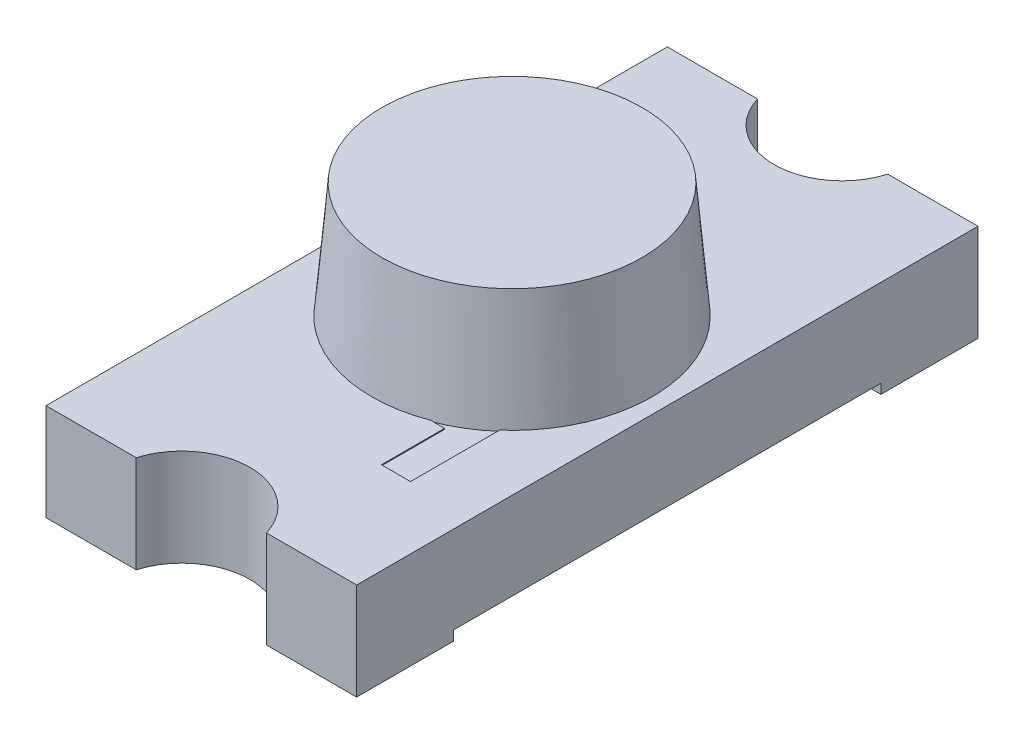
ISO-10303-21;
HEADER;
FILE_DESCRIPTION(('STEP AP214'),'2;1');
FILE_NAME('part.step','',(''),(''),'','','');
FILE_SCHEMA(('AUTOMOTIVE_DESIGN { 1 0 10303 214 1 1 1 1 }'));
ENDSEC;
DATA;
#1=APPLICATION_CONTEXT('core data for automotive mechanical design processes');
#2=APPLICATION_PROTOCOL_DEFINITION('international standard','automotive_design',2000,#1);
#3=PRODUCT_CONTEXT('',#1,'mechanical');
#4=PRODUCT('Part','Part','',(#3));
#5=PRODUCT_RELATED_PRODUCT_CATEGORY('part','',(#4));
#6=PRODUCT_DEFINITION_FORMATION('','',#4);
#7=PRODUCT_DEFINITION_CONTEXT('part definition',#1,'design');
#8=PRODUCT_DEFINITION('design','',#6,#7);
#9=PRODUCT_DEFINITION_SHAPE('','',#8);
#10=(LENGTH_UNIT() NAMED_UNIT(*) SI_UNIT(.MILLI.,.METRE.));
#11=(NAMED_UNIT(*) PLANE_ANGLE_UNIT() SI_UNIT($,.RADIAN.));
#12=(NAMED_UNIT(*) SI_UNIT($,.STERADIAN.) SOLID_ANGLE_UNIT());
#13=UNCERTAINTY_MEASURE_WITH_UNIT(LENGTH_MEASURE(1.E-05),#10,'distance_accuracy_value','');
#14=(GEOMETRIC_REPRESENTATION_CONTEXT(3) GLOBAL_UNCERTAINTY_ASSIGNED_CONTEXT((#13)) GLOBAL_UNIT_ASSIGNED_CONTEXT((#10,
#11,#12)) REPRESENTATION_CONTEXT('',''));
#15=CARTESIAN_POINT('',(0.,0.,0.));
#16=DIRECTION('',(0.,0.,1.));
#17=DIRECTION('',(1.,0.,0.));
#18=AXIS2_PLACEMENT_3D('',#15,#16,#17);
#19=CARTESIAN_POINT('',(0.,0.495,0.));
#20=DIRECTION('',(0.,-1.,0.));
#21=DIRECTION('',(0.,0.,1.));
#22=AXIS2_PLACEMENT_3D('',#19,#20,#21);
#23=CONICAL_SURFACE('',#22,0.722303878658216,0.0872664625997167);
#24=CARTESIAN_POINT('',(0.,1.095,0.));
#25=DIRECTION('',(0.,1.,0.));
#26=DIRECTION('',(0.,0.,1.));
#27=AXIS2_PLACEMENT_3D('',#24,#25,#26);
#28=CIRCLE('',#27,0.669810680542662);
#29=CARTESIAN_POINT('',(0.,1.095,0.669810680542662));
#30=VERTEX_POINT('',#29);
#31=EDGE_CURVE('E12',#30,#30,#28,.T.);
#32=ORIENTED_EDGE('',*,*,#31,.F.);
#33=EDGE_LOOP('',(#32));
#34=FACE_BOUND('',#33,.T.);
#35=CARTESIAN_POINT('',(0.,0.495,0.));
#36=DIRECTION('',(0.,1.,0.));
#37=DIRECTION('',(0.,0.,1.));
#38=AXIS2_PLACEMENT_3D('',#35,#36,#37);
#39=CIRCLE('',#38,0.722303878658216);
#40=CARTESIAN_POINT('',(0.,0.495,0.722303878658216));
#41=VERTEX_POINT('',#40);
#42=EDGE_CURVE('E51',#41,#41,#39,.T.);
#43=ORIENTED_EDGE('',*,*,#42,.T.);
#44=EDGE_LOOP('',(#43));
#45=FACE_BOUND('',#44,.T.);
#46=ADVANCED_FACE('F45',(#34,#45),#23,.T.);
#47=CARTESIAN_POINT('',(0.,1.095,0.));
#48=DIRECTION('',(0.,1.,0.));
#49=DIRECTION('',(0.,0.,1.));
#50=AXIS2_PLACEMENT_3D('',#47,#48,#49);
#51=PLANE('',#50);
#52=ORIENTED_EDGE('',*,*,#31,.T.);
#53=EDGE_LOOP('',(#52));
#54=FACE_BOUND('',#53,.T.);
#55=ADVANCED_FACE('F60',(#54),#51,.T.);
#56=CARTESIAN_POINT('',(0.,0.495,0.));
#57=DIRECTION('',(0.,1.,0.));
#58=DIRECTION('',(0.,0.,1.));
#59=AXIS2_PLACEMENT_3D('',#56,#57,#58);
#60=PLANE('',#59);
#61=ORIENTED_EDGE('',*,*,#42,.F.);
#62=EDGE_LOOP('',(#61));
#63=FACE_BOUND('',#62,.T.);
#64=ADVANCED_FACE('F58',(#63),#60,.F.);
#65=CLOSED_SHELL('',(#46,#55,#64));
#66=MANIFOLD_SOLID_BREP('B2',#65);
#67=CARTESIAN_POINT('',(-2.92422569718548,0.495,0.));
#68=DIRECTION('',(0.,1.,0.));
#69=DIRECTION('',(0.,0.,1.));
#70=AXIS2_PLACEMENT_3D('',#67,#68,#69);
#71=PLANE('',#70);
#72=DIRECTION('',(0.,0.,1.));
#73=VECTOR('',#72,1.);
#74=CARTESIAN_POINT('',(0.477379024541812,0.495,0.));
#75=LINE('',#74,#73);
#76=CARTESIAN_POINT('',(0.477379024541812,0.495,0.525));
#77=VERTEX_POINT('',#76);
#78=CARTESIAN_POINT('',(0.477379024541812,0.495,1.));
#79=VERTEX_POINT('',#78);
#80=EDGE_CURVE('E366',#77,#79,#75,.T.);
#81=ORIENTED_EDGE('',*,*,#80,.F.);
#82=DIRECTION('',(1.,0.,0.));
#83=VECTOR('',#82,1.);
#84=CARTESIAN_POINT('',(-2.92422569718548,0.495,0.525));
#85=LINE('',#84,#83);
#86=CARTESIAN_POINT('',(-0.075,0.495,0.525));
#87=VERTEX_POINT('',#86);
#88=EDGE_CURVE('E368',#87,#77,#85,.T.);
#89=ORIENTED_EDGE('',*,*,#88,.F.);
#90=DIRECTION('',(0.,0.,1.));
#91=VECTOR('',#90,1.);
#92=CARTESIAN_POINT('',(-0.075,0.495,0.));
#93=LINE('',#92,#91);
#94=CARTESIAN_POINT('',(-0.075,0.495,0.225));
#95=VERTEX_POINT('',#94);
#96=EDGE_CURVE('E371',#95,#87,#93,.T.);
#97=ORIENTED_EDGE('',*,*,#96,.F.);
#98=DIRECTION('',(1.,0.,0.));
#99=VECTOR('',#98,1.);
#100=CARTESIAN_POINT('',(-2.92422569718548,0.495,0.225000000000001));
#101=LINE('',#100,#99);
#102=CARTESIAN_POINT('',(0.225,0.495,0.225));
#103=VERTEX_POINT('',#102);
#104=EDGE_CURVE('E373',#95,#103,#101,.T.);
#105=ORIENTED_EDGE('',*,*,#104,.T.);
#106=DIRECTION('',(0.,0.,1.));
#107=VECTOR('',#106,1.);
#108=CARTESIAN_POINT('',(0.225,0.495,0.));
#109=LINE('',#108,#107);
#110=CARTESIAN_POINT('',(0.225,0.495,-0.225));
#111=VERTEX_POINT('',#110);
#112=EDGE_CURVE('E376',#111,#103,#109,.T.);
#113=ORIENTED_EDGE('',*,*,#112,.F.);
#114=DIRECTION('',(1.,0.,0.));
#115=VECTOR('',#114,1.);
#116=CARTESIAN_POINT('',(-2.92422569718548,0.495,-0.225));
#117=LINE('',#116,#115);
#118=CARTESIAN_POINT('',(-0.225,0.495,-0.225));
#119=VERTEX_POINT('',#118);
#120=EDGE_CURVE('E378',#119,#111,#117,.T.);
#121=ORIENTED_EDGE('',*,*,#120,.F.);
#122=DIRECTION('',(0.,0.,1.));
#123=VECTOR('',#122,1.);
#124=CARTESIAN_POINT('',(-0.225,0.495,0.));
#125=LINE('',#124,#123);
#126=CARTESIAN_POINT('',(-0.225,0.495,0.675));
#127=VERTEX_POINT('',#126);
#128=EDGE_CURVE('E380',#119,#127,#125,.T.);
#129=ORIENTED_EDGE('',*,*,#128,.T.);
#130=DIRECTION('',(1.,0.,0.));
#131=VECTOR('',#130,1.);
#132=CARTESIAN_POINT('',(-2.92422569718548,0.495,0.675));
#133=LINE('',#132,#131);
#134=CARTESIAN_POINT('',(0.327379024541811,0.495,0.675));
#135=VERTEX_POINT('',#134);
#136=EDGE_CURVE('E383',#127,#135,#133,.T.);
#137=ORIENTED_EDGE('',*,*,#136,.T.);
#138=DIRECTION('',(0.,0.,1.));
#139=VECTOR('',#138,1.);
#140=CARTESIAN_POINT('',(0.327379024541812,0.495,0.));
#141=LINE('',#140,#139);
#142=CARTESIAN_POINT('',(0.327379024541812,0.495,1.));
#143=VERTEX_POINT('',#142);
#144=EDGE_CURVE('E386',#135,#143,#141,.T.);
#145=ORIENTED_EDGE('',*,*,#144,.T.);
#146=DIRECTION('',(1.,0.,0.));
#147=VECTOR('',#146,1.);
#148=CARTESIAN_POINT('',(-2.92422569718548,0.495,1.));
#149=LINE('',#148,#147);
#150=EDGE_CURVE('E389',#143,#79,#149,.T.);
#151=ORIENTED_EDGE('',*,*,#150,.T.);
#152=EDGE_LOOP('',(#81,#89,#97,#105,#113,#121,#129,#137,#145,#151));
#153=FACE_BOUND('',#152,.T.);
#154=DIRECTION('',(1.,0.,0.));
#155=VECTOR('',#154,1.);
#156=CARTESIAN_POINT('',(-0.195,0.495,0.195));
#157=LINE('',#156,#155);
#158=CARTESIAN_POINT('',(-0.195,0.495,0.195));
#159=VERTEX_POINT('',#158);
#160=CARTESIAN_POINT('',(0.195,0.495,0.195));
#161=VERTEX_POINT('',#160);
#162=EDGE_CURVE('E961',#159,#161,#157,.T.);
#163=ORIENTED_EDGE('',*,*,#162,.F.);
#164=DIRECTION('',(0.,0.,1.));
#165=VECTOR('',#164,1.);
#166=CARTESIAN_POINT('',(-0.195,0.495,-0.195));
#167=LINE('',#166,#165);
#168=CARTESIAN_POINT('',(-0.195,0.495,-0.195));
#169=VERTEX_POINT('',#168);
#170=EDGE_CURVE('E316',#169,#159,#167,.T.);
#171=ORIENTED_EDGE('',*,*,#170,.F.);
#172=DIRECTION('',(-1.,0.,0.));
#173=VECTOR('',#172,1.);
#174=CARTESIAN_POINT('',(-0.195,0.495,-0.195));
#175=LINE('',#174,#173);
#176=CARTESIAN_POINT('',(0.195,0.495,-0.195));
#177=VERTEX_POINT('',#176);
#178=EDGE_CURVE('E312',#177,#169,#175,.T.);
#179=ORIENTED_EDGE('',*,*,#178,.F.);
#180=DIRECTION('',(0.,0.,-1.));
#181=VECTOR('',#180,1.);
#182=CARTESIAN_POINT('',(0.195,0.495,-0.195));
#183=LINE('',#182,#181);
#184=EDGE_CURVE('E958',#161,#177,#183,.T.);
#185=ORIENTED_EDGE('',*,*,#184,.F.);
#186=EDGE_LOOP('',(#163,#171,#179,#185));
#187=FACE_BOUND('',#186,.T.);
#188=ADVANCED_FACE('F85',(#153,#187),#71,.T.);
#189=CARTESIAN_POINT('',(0.8,0.5,1.6));
#190=DIRECTION('',(0.,-1.,0.));
#191=DIRECTION('',(0.,0.,-1.));
#192=AXIS2_PLACEMENT_3D('',#189,#190,#191);
#193=PLANE('',#192);
#194=DIRECTION('',(0.,0.,-1.));
#195=VECTOR('',#194,1.);
#196=CARTESIAN_POINT('',(0.276447509101705,0.5,0.));
#197=LINE('',#196,#195);
#198=CARTESIAN_POINT('',(0.276447509101705,0.5,-0.450698671652405));
#199=VERTEX_POINT('',#198);
#200=CARTESIAN_POINT('',(0.276447509101705,0.5,-0.630698671652405));
#201=VERTEX_POINT('',#200);
#202=EDGE_CURVE('E319',#199,#201,#197,.T.);
#203=ORIENTED_EDGE('',*,*,#202,.F.);
#204=DIRECTION('',(1.,0.,0.));
#205=VECTOR('',#204,1.);
#206=CARTESIAN_POINT('',(-2.92422569718548,0.5,-0.450698671652405));
#207=LINE('',#206,#205);
#208=CARTESIAN_POINT('',(-0.457414609839892,0.5,-0.450698671652405));
#209=VERTEX_POINT('',#208);
#210=EDGE_CURVE('E108',#209,#199,#207,.T.);
#211=ORIENTED_EDGE('',*,*,#210,.F.);
#212=DIRECTION('',(0.,0.,1.));
#213=VECTOR('',#212,1.);
#214=CARTESIAN_POINT('',(-0.457414609839892,0.5,0.));
#215=LINE('',#214,#213);
#216=CARTESIAN_POINT('',(-0.457414609839892,0.5,-1.));
#217=VERTEX_POINT('',#216);
#218=EDGE_CURVE('E328',#217,#209,#215,.T.);
#219=ORIENTED_EDGE('',*,*,#218,.F.);
#220=DIRECTION('',(1.,0.,0.));
#221=VECTOR('',#220,1.);
#222=CARTESIAN_POINT('',(-2.92422569718548,0.5,-1.));
#223=LINE('',#222,#221);
#224=CARTESIAN_POINT('',(-0.277414609839892,0.5,-1.));
#225=VERTEX_POINT('',#224);
#226=EDGE_CURVE('E349',#217,#225,#223,.T.);
#227=ORIENTED_EDGE('',*,*,#226,.T.);
#228=DIRECTION('',(0.,0.,1.));
#229=VECTOR('',#228,1.);
#230=CARTESIAN_POINT('',(-0.277414609839892,0.5,0.));
#231=LINE('',#230,#229);
#232=CARTESIAN_POINT('',(-0.277414609839892,0.5,-0.630698671652405));
#233=VERTEX_POINT('',#232);
#234=EDGE_CURVE('E346',#225,#233,#231,.T.);
#235=ORIENTED_EDGE('',*,*,#234,.T.);
#236=DIRECTION('',(1.,0.,0.));
#237=VECTOR('',#236,1.);
#238=CARTESIAN_POINT('',(-2.92422569718548,0.5,-0.630698671652405));
#239=LINE('',#238,#237);
#240=EDGE_CURVE('E343',#233,#201,#239,.T.);
#241=ORIENTED_EDGE('',*,*,#240,.T.);
#242=EDGE_LOOP('',(#203,#211,#219,#227,#235,#241));
#243=FACE_BOUND('',#242,.T.);
#244=CARTESIAN_POINT('',(0.,0.500000000000001,1.7));
#245=DIRECTION('',(0.,1.,0.));
#246=DIRECTION('',(0.,0.,1.));
#247=AXIS2_PLACEMENT_3D('',#244,#245,#246);
#248=CIRCLE('',#247,0.35);
#249=CARTESIAN_POINT('',(0.335410196624969,0.500000000000001,1.6));
#250=VERTEX_POINT('',#249);
#251=CARTESIAN_POINT('',(-0.335410196624969,0.500000000000001,1.6));
#252=VERTEX_POINT('',#251);
#253=EDGE_CURVE('E442',#250,#252,#248,.T.);
#254=ORIENTED_EDGE('',*,*,#253,.F.);
#255=DIRECTION('',(-1.,0.,0.));
#256=VECTOR('',#255,1.);
#257=CARTESIAN_POINT('',(0.8,0.5,1.6));
#258=LINE('',#257,#256);
#259=CARTESIAN_POINT('',(0.8,0.5,1.6));
#260=VERTEX_POINT('',#259);
#261=EDGE_CURVE('E499',#260,#250,#258,.T.);
#262=ORIENTED_EDGE('',*,*,#261,.F.);
#263=DIRECTION('',(0.,0.,1.));
#264=VECTOR('',#263,1.);
#265=CARTESIAN_POINT('',(0.8,0.5,1.6));
#266=LINE('',#265,#264);
#267=CARTESIAN_POINT('',(0.8,0.500000000000001,-1.6));
#268=VERTEX_POINT('',#267);
#269=EDGE_CURVE('E496',#268,#260,#266,.T.);
#270=ORIENTED_EDGE('',*,*,#269,.F.);
#271=DIRECTION('',(-1.,0.,0.));
#272=VECTOR('',#271,1.);
#273=CARTESIAN_POINT('',(0.8,0.500000000000001,-1.6));
#274=LINE('',#273,#272);
#275=CARTESIAN_POINT('',(0.335410196624969,0.500000000000001,-1.6));
#276=VERTEX_POINT('',#275);
#277=EDGE_CURVE('E503',#268,#276,#274,.T.);
#278=ORIENTED_EDGE('',*,*,#277,.T.);
#279=CARTESIAN_POINT('',(0.,0.500000000000001,-1.7));
#280=DIRECTION('',(0.,-1.,0.));
#281=DIRECTION('',(0.,0.,-1.));
#282=AXIS2_PLACEMENT_3D('',#279,#280,#281);
#283=CIRCLE('',#282,0.35);
#284=CARTESIAN_POINT('',(-0.335410196624969,0.500000000000001,-1.6));
#285=VERTEX_POINT('',#284);
#286=EDGE_CURVE('E43',#285,#276,#283,.F.);
#287=ORIENTED_EDGE('',*,*,#286,.F.);
#288=CARTESIAN_POINT('',(-0.8,0.500000000000001,-1.6));
#289=VERTEX_POINT('',#288);
#290=EDGE_CURVE('E502',#285,#289,#274,.T.);
#291=ORIENTED_EDGE('',*,*,#290,.T.);
#292=DIRECTION('',(0.,0.,1.));
#293=VECTOR('',#292,1.);
#294=CARTESIAN_POINT('',(-0.8,0.5,1.6));
#295=LINE('',#294,#293);
#296=CARTESIAN_POINT('',(-0.8,0.5,1.6));
#297=VERTEX_POINT('',#296);
#298=EDGE_CURVE('E478',#289,#297,#295,.T.);
#299=ORIENTED_EDGE('',*,*,#298,.T.);
#300=EDGE_CURVE('E498',#252,#297,#258,.T.);
#301=ORIENTED_EDGE('',*,*,#300,.F.);
#302=EDGE_LOOP('',(#254,#262,#270,#278,#287,#291,#299,#301));
#303=FACE_BOUND('',#302,.T.);
#304=DIRECTION('',(0.,0.,1.));
#305=VECTOR('',#304,1.);
#306=CARTESIAN_POINT('',(0.477379024541812,0.5,0.));
#307=LINE('',#306,#305);
#308=CARTESIAN_POINT('',(0.477379024541812,0.5,0.525));
#309=VERTEX_POINT('',#308);
#310=CARTESIAN_POINT('',(0.477379024541812,0.5,1.));
#311=VERTEX_POINT('',#310);
#312=EDGE_CURVE('E356',#309,#311,#307,.T.);
#313=ORIENTED_EDGE('',*,*,#312,.T.);
#314=DIRECTION('',(1.,0.,0.));
#315=VECTOR('',#314,1.);
#316=CARTESIAN_POINT('',(-2.92422569718548,0.5,1.));
#317=LINE('',#316,#315);
#318=CARTESIAN_POINT('',(0.327379024541812,0.5,1.));
#319=VERTEX_POINT('',#318);
#320=EDGE_CURVE('E369',#319,#311,#317,.T.);
#321=ORIENTED_EDGE('',*,*,#320,.F.);
#322=DIRECTION('',(0.,0.,1.));
#323=VECTOR('',#322,1.);
#324=CARTESIAN_POINT('',(0.327379024541812,0.5,0.));
#325=LINE('',#324,#323);
#326=CARTESIAN_POINT('',(0.327379024541811,0.5,0.675));
#327=VERTEX_POINT('',#326);
#328=EDGE_CURVE('E416',#327,#319,#325,.T.);
#329=ORIENTED_EDGE('',*,*,#328,.F.);
#330=DIRECTION('',(1.,0.,0.));
#331=VECTOR('',#330,1.);
#332=CARTESIAN_POINT('',(-2.92422569718548,0.5,0.675));
#333=LINE('',#332,#331);
#334=CARTESIAN_POINT('',(-0.225,0.5,0.675));
#335=VERTEX_POINT('',#334);
#336=EDGE_CURVE('E413',#335,#327,#333,.T.);
#337=ORIENTED_EDGE('',*,*,#336,.F.);
#338=DIRECTION('',(0.,0.,1.));
#339=VECTOR('',#338,1.);
#340=CARTESIAN_POINT('',(-0.225,0.5,0.));
#341=LINE('',#340,#339);
#342=CARTESIAN_POINT('',(-0.225,0.5,-0.225));
#343=VERTEX_POINT('',#342);
#344=EDGE_CURVE('E410',#343,#335,#341,.T.);
#345=ORIENTED_EDGE('',*,*,#344,.F.);
#346=DIRECTION('',(1.,0.,0.));
#347=VECTOR('',#346,1.);
#348=CARTESIAN_POINT('',(-2.92422569718548,0.5,-0.225));
#349=LINE('',#348,#347);
#350=CARTESIAN_POINT('',(0.225,0.5,-0.225));
#351=VERTEX_POINT('',#350);
#352=EDGE_CURVE('E407',#343,#351,#349,.T.);
#353=ORIENTED_EDGE('',*,*,#352,.T.);
#354=DIRECTION('',(0.,0.,1.));
#355=VECTOR('',#354,1.);
#356=CARTESIAN_POINT('',(0.225,0.5,0.));
#357=LINE('',#356,#355);
#358=CARTESIAN_POINT('',(0.225,0.5,0.225));
#359=VERTEX_POINT('',#358);
#360=EDGE_CURVE('E404',#351,#359,#357,.T.);
#361=ORIENTED_EDGE('',*,*,#360,.T.);
#362=DIRECTION('',(1.,0.,0.));
#363=VECTOR('',#362,1.);
#364=CARTESIAN_POINT('',(-2.92422569718548,0.5,0.225000000000001));
#365=LINE('',#364,#363);
#366=CARTESIAN_POINT('',(-0.075,0.5,0.225));
#367=VERTEX_POINT('',#366);
#368=EDGE_CURVE('E401',#367,#359,#365,.T.);
#369=ORIENTED_EDGE('',*,*,#368,.F.);
#370=DIRECTION('',(0.,0.,1.));
#371=VECTOR('',#370,1.);
#372=CARTESIAN_POINT('',(-0.075,0.5,0.));
#373=LINE('',#372,#371);
#374=CARTESIAN_POINT('',(-0.075,0.5,0.525));
#375=VERTEX_POINT('',#374);
#376=EDGE_CURVE('E398',#367,#375,#373,.T.);
#377=ORIENTED_EDGE('',*,*,#376,.T.);
#378=DIRECTION('',(1.,0.,0.));
#379=VECTOR('',#378,1.);
#380=CARTESIAN_POINT('',(-2.92422569718548,0.5,0.525));
#381=LINE('',#380,#379);
#382=EDGE_CURVE('E395',#375,#309,#381,.T.);
#383=ORIENTED_EDGE('',*,*,#382,.T.);
#384=EDGE_LOOP('',(#313,#321,#329,#337,#345,#353,#361,#369,#377,#383));
#385=FACE_BOUND('',#384,.T.);
#386=ADVANCED_FACE('F537',(#243,#303,#385),#193,.F.);
#387=CARTESIAN_POINT('',(0.8,0.5,1.6));
#388=DIRECTION('',(0.,0.,-1.));
#389=DIRECTION('',(0.,1.,0.));
#390=AXIS2_PLACEMENT_3D('',#387,#388,#389);
#391=PLANE('',#390);
#392=DIRECTION('',(0.,-1.,0.));
#393=VECTOR('',#392,1.);
#394=CARTESIAN_POINT('',(0.335410196624969,0.500000000000001,1.6));
#395=LINE('',#394,#393);
#396=CARTESIAN_POINT('',(0.335410196624969,0.,1.6));
#397=VERTEX_POINT('',#396);
#398=EDGE_CURVE('E448',#397,#250,#395,.F.);
#399=ORIENTED_EDGE('',*,*,#398,.F.);
#400=DIRECTION('',(-1.,0.,0.));
#401=VECTOR('',#400,1.);
#402=CARTESIAN_POINT('',(0.8,0.,1.6));
#403=LINE('',#402,#401);
#404=CARTESIAN_POINT('',(0.8,0.,1.6));
#405=VERTEX_POINT('',#404);
#406=EDGE_CURVE('E93',#405,#397,#403,.T.);
#407=ORIENTED_EDGE('',*,*,#406,.F.);
#408=DIRECTION('',(0.,-1.,0.));
#409=VECTOR('',#408,1.);
#410=CARTESIAN_POINT('',(0.8,0.5,1.6));
#411=LINE('',#410,#409);
#412=EDGE_CURVE('E481',#260,#405,#411,.T.);
#413=ORIENTED_EDGE('',*,*,#412,.F.);
#414=ORIENTED_EDGE('',*,*,#261,.T.);
#415=EDGE_LOOP('',(#399,#407,#413,#414));
#416=FACE_BOUND('',#415,.T.);
#417=ADVANCED_FACE('F87',(#416),#391,.F.);
#418=DIRECTION('',(0.,-1.,0.));
#419=VECTOR('',#418,1.);
#420=CARTESIAN_POINT('',(-0.335410196624969,0.500000000000001,1.6));
#421=LINE('',#420,#419);
#422=CARTESIAN_POINT('',(-0.335410196624969,0.,1.6));
#423=VERTEX_POINT('',#422);
#424=EDGE_CURVE('E444',#252,#423,#421,.T.);
#425=ORIENTED_EDGE('',*,*,#424,.F.);
#426=ORIENTED_EDGE('',*,*,#300,.T.);
#427=DIRECTION('',(0.,-1.,0.));
#428=VECTOR('',#427,1.);
#429=CARTESIAN_POINT('',(-0.8,0.5,1.6));
#430=LINE('',#429,#428);
#431=CARTESIAN_POINT('',(-0.8,0.,1.6));
#432=VERTEX_POINT('',#431);
#433=EDGE_CURVE('E457',#297,#432,#430,.T.);
#434=ORIENTED_EDGE('',*,*,#433,.T.);
#435=EDGE_CURVE('E517',#423,#432,#403,.T.);
#436=ORIENTED_EDGE('',*,*,#435,.F.);
#437=EDGE_LOOP('',(#425,#426,#434,#436));
#438=FACE_BOUND('',#437,.T.);
#439=ADVANCED_FACE('F533',(#438),#391,.F.);
#440=CARTESIAN_POINT('',(0.8,0.,1.6));
#441=DIRECTION('',(0.,1.,0.));
#442=DIRECTION('',(0.,0.,1.));
#443=AXIS2_PLACEMENT_3D('',#440,#441,#442);
#444=PLANE('',#443);
#445=CARTESIAN_POINT('',(0.,0.,1.7));
#446=DIRECTION('',(0.,1.,0.));
#447=DIRECTION('',(0.,0.,1.));
#448=AXIS2_PLACEMENT_3D('',#445,#446,#447);
#449=CIRCLE('',#448,0.35);
#450=EDGE_CURVE('E423',#397,#423,#449,.T.);
#451=ORIENTED_EDGE('',*,*,#450,.T.);
#452=ORIENTED_EDGE('',*,*,#435,.T.);
#453=DIRECTION('',(0.,0.,-1.));
#454=VECTOR('',#453,1.);
#455=CARTESIAN_POINT('',(-0.8,0.,1.6));
#456=LINE('',#455,#454);
#457=CARTESIAN_POINT('',(-0.8,0.,1.1));
#458=VERTEX_POINT('',#457);
#459=EDGE_CURVE('E460',#432,#458,#456,.T.);
#460=ORIENTED_EDGE('',*,*,#459,.T.);
#461=DIRECTION('',(-1.,0.,0.));
#462=VECTOR('',#461,1.);
#463=CARTESIAN_POINT('',(0.8,0.,1.1));
#464=LINE('',#463,#462);
#465=CARTESIAN_POINT('',(0.8,0.,1.1));
#466=VERTEX_POINT('',#465);
#467=EDGE_CURVE('E516',#466,#458,#464,.T.);
#468=ORIENTED_EDGE('',*,*,#467,.F.);
#469=DIRECTION('',(0.,0.,-1.));
#470=VECTOR('',#469,1.);
#471=CARTESIAN_POINT('',(0.8,0.,1.6));
#472=LINE('',#471,#470);
#473=EDGE_CURVE('E484',#405,#466,#472,.T.);
#474=ORIENTED_EDGE('',*,*,#473,.F.);
#475=ORIENTED_EDGE('',*,*,#406,.T.);
#476=EDGE_LOOP('',(#451,#452,#460,#468,#474,#475));
#477=FACE_BOUND('',#476,.T.);
#478=ADVANCED_FACE('F523',(#477),#444,.F.);
#479=CARTESIAN_POINT('',(0.8,0.,-1.1));
#480=DIRECTION('',(0.,1.,0.));
#481=DIRECTION('',(0.,0.,1.));
#482=AXIS2_PLACEMENT_3D('',#479,#480,#481);
#483=PLANE('',#482);
#484=CARTESIAN_POINT('',(0.,0.,-1.7));
#485=DIRECTION('',(0.,1.,0.));
#486=DIRECTION('',(0.,0.,1.));
#487=AXIS2_PLACEMENT_3D('',#484,#485,#486);
#488=CIRCLE('',#487,0.35);
#489=CARTESIAN_POINT('',(-0.335410196624969,0.,-1.6));
#490=VERTEX_POINT('',#489);
#491=CARTESIAN_POINT('',(0.335410196624969,0.,-1.6));
#492=VERTEX_POINT('',#491);
#493=EDGE_CURVE('E450',#490,#492,#488,.T.);
#494=ORIENTED_EDGE('',*,*,#493,.T.);
#495=DIRECTION('',(-1.,0.,0.));
#496=VECTOR('',#495,1.);
#497=CARTESIAN_POINT('',(0.8,0.,-1.6));
#498=LINE('',#497,#496);
#499=CARTESIAN_POINT('',(0.8,0.,-1.6));
#500=VERTEX_POINT('',#499);
#501=EDGE_CURVE('E507',#500,#492,#498,.T.);
#502=ORIENTED_EDGE('',*,*,#501,.F.);
#503=DIRECTION('',(0.,0.,-1.));
#504=VECTOR('',#503,1.);
#505=CARTESIAN_POINT('',(0.8,0.,-1.1));
#506=LINE('',#505,#504);
#507=CARTESIAN_POINT('',(0.8,0.,-1.1));
#508=VERTEX_POINT('',#507);
#509=EDGE_CURVE('E492',#508,#500,#506,.T.);
#510=ORIENTED_EDGE('',*,*,#509,.F.);
#511=DIRECTION('',(-1.,0.,0.));
#512=VECTOR('',#511,1.);
#513=CARTESIAN_POINT('',(0.8,0.,-1.1));
#514=LINE('',#513,#512);
#515=CARTESIAN_POINT('',(-0.8,0.,-1.1));
#516=VERTEX_POINT('',#515);
#517=EDGE_CURVE('E510',#508,#516,#514,.T.);
#518=ORIENTED_EDGE('',*,*,#517,.T.);
#519=DIRECTION('',(0.,0.,-1.));
#520=VECTOR('',#519,1.);
#521=CARTESIAN_POINT('',(-0.8,0.,-1.1));
#522=LINE('',#521,#520);
#523=CARTESIAN_POINT('',(-0.8,0.,-1.6));
#524=VERTEX_POINT('',#523);
#525=EDGE_CURVE('E472',#516,#524,#522,.T.);
#526=ORIENTED_EDGE('',*,*,#525,.T.);
#527=EDGE_CURVE('E506',#490,#524,#498,.T.);
#528=ORIENTED_EDGE('',*,*,#527,.F.);
#529=EDGE_LOOP('',(#494,#502,#510,#518,#526,#528));
#530=FACE_BOUND('',#529,.T.);
#531=ADVANCED_FACE('F548',(#530),#483,.F.);
#532=CARTESIAN_POINT('',(0.8,0.500000000000001,-1.6));
#533=DIRECTION('',(0.,0.,1.));
#534=DIRECTION('',(0.,-1.,0.));
#535=AXIS2_PLACEMENT_3D('',#532,#533,#534);
#536=PLANE('',#535);
#537=DIRECTION('',(0.,-1.,0.));
#538=VECTOR('',#537,1.);
#539=CARTESIAN_POINT('',(-0.335410196624969,0.500000000000001,-1.6));
#540=LINE('',#539,#538);
#541=EDGE_CURVE('E455',#490,#285,#540,.F.);
#542=ORIENTED_EDGE('',*,*,#541,.F.);
#543=ORIENTED_EDGE('',*,*,#527,.T.);
#544=DIRECTION('',(0.,1.,0.));
#545=VECTOR('',#544,1.);
#546=CARTESIAN_POINT('',(-0.8,0.500000000000001,-1.6));
#547=LINE('',#546,#545);
#548=EDGE_CURVE('E475',#524,#289,#547,.T.);
#549=ORIENTED_EDGE('',*,*,#548,.T.);
#550=ORIENTED_EDGE('',*,*,#290,.F.);
#551=EDGE_LOOP('',(#542,#543,#549,#550));
#552=FACE_BOUND('',#551,.T.);
#553=ADVANCED_FACE('F863',(#552),#536,.F.);
#554=DIRECTION('',(0.,-1.,0.));
#555=VECTOR('',#554,1.);
#556=CARTESIAN_POINT('',(0.335410196624969,0.500000000000001,-1.6));
#557=LINE('',#556,#555);
#558=EDGE_CURVE('E453',#276,#492,#557,.T.);
#559=ORIENTED_EDGE('',*,*,#558,.F.);
#560=ORIENTED_EDGE('',*,*,#277,.F.);
#561=DIRECTION('',(0.,1.,0.));
#562=VECTOR('',#561,1.);
#563=CARTESIAN_POINT('',(0.8,0.500000000000001,-1.6));
#564=LINE('',#563,#562);
#565=EDGE_CURVE('E494',#500,#268,#564,.T.);
#566=ORIENTED_EDGE('',*,*,#565,.F.);
#567=ORIENTED_EDGE('',*,*,#501,.T.);
#568=EDGE_LOOP('',(#559,#560,#566,#567));
#569=FACE_BOUND('',#568,.T.);
#570=ADVANCED_FACE('F858',(#569),#536,.F.);
#571=CARTESIAN_POINT('',(0.8,0.0500000000000005,1.1));
#572=DIRECTION('',(0.,0.,1.));
#573=DIRECTION('',(1.,0.,0.));
#574=AXIS2_PLACEMENT_3D('',#571,#572,#573);
#575=PLANE('',#574);
#576=ORIENTED_EDGE('',*,*,#467,.T.);
#577=DIRECTION('',(0.,1.,0.));
#578=VECTOR('',#577,1.);
#579=CARTESIAN_POINT('',(-0.8,0.0500000000000005,1.1));
#580=LINE('',#579,#578);
#581=CARTESIAN_POINT('',(-0.8,0.0500000000000005,1.1));
#582=VERTEX_POINT('',#581);
#583=EDGE_CURVE('E463',#458,#582,#580,.T.);
#584=ORIENTED_EDGE('',*,*,#583,.T.);
#585=DIRECTION('',(-1.,0.,0.));
#586=VECTOR('',#585,1.);
#587=CARTESIAN_POINT('',(0.8,0.0500000000000005,1.1));
#588=LINE('',#587,#586);
#589=CARTESIAN_POINT('',(0.8,0.0500000000000005,1.1));
#590=VERTEX_POINT('',#589);
#591=EDGE_CURVE('E514',#590,#582,#588,.T.);
#592=ORIENTED_EDGE('',*,*,#591,.F.);
#593=DIRECTION('',(0.,1.,0.));
#594=VECTOR('',#593,1.);
#595=CARTESIAN_POINT('',(0.8,0.0500000000000005,1.1));
#596=LINE('',#595,#594);
#597=EDGE_CURVE('E486',#466,#590,#596,.T.);
#598=ORIENTED_EDGE('',*,*,#597,.F.);
#599=EDGE_LOOP('',(#576,#584,#592,#598));
#600=FACE_BOUND('',#599,.T.);
#601=ADVANCED_FACE('F562',(#600),#575,.F.);
#602=CARTESIAN_POINT('',(0.8,0.0500000000000005,1.1));
#603=DIRECTION('',(0.,1.,0.));
#604=DIRECTION('',(0.,0.,1.));
#605=AXIS2_PLACEMENT_3D('',#602,#603,#604);
#606=PLANE('',#605);
#607=ORIENTED_EDGE('',*,*,#591,.T.);
#608=DIRECTION('',(0.,0.,-1.));
#609=VECTOR('',#608,1.);
#610=CARTESIAN_POINT('',(-0.8,0.0500000000000005,1.1));
#611=LINE('',#610,#609);
#612=CARTESIAN_POINT('',(-0.8,0.0500000000000005,-1.1));
#613=VERTEX_POINT('',#612);
#614=EDGE_CURVE('E466',#582,#613,#611,.T.);
#615=ORIENTED_EDGE('',*,*,#614,.T.);
#616=DIRECTION('',(-1.,0.,0.));
#617=VECTOR('',#616,1.);
#618=CARTESIAN_POINT('',(0.8,0.0500000000000005,-1.1));
#619=LINE('',#618,#617);
#620=CARTESIAN_POINT('',(0.8,0.0500000000000005,-1.1));
#621=VERTEX_POINT('',#620);
#622=EDGE_CURVE('E512',#621,#613,#619,.T.);
#623=ORIENTED_EDGE('',*,*,#622,.F.);
#624=DIRECTION('',(0.,0.,-1.));
#625=VECTOR('',#624,1.);
#626=CARTESIAN_POINT('',(0.8,0.0500000000000005,1.1));
#627=LINE('',#626,#625);
#628=EDGE_CURVE('E488',#590,#621,#627,.T.);
#629=ORIENTED_EDGE('',*,*,#628,.F.);
#630=EDGE_LOOP('',(#607,#615,#623,#629));
#631=FACE_BOUND('',#630,.T.);
#632=ADVANCED_FACE('F557',(#631),#606,.F.);
#633=CARTESIAN_POINT('',(0.8,0.0500000000000005,-1.1));
#634=DIRECTION('',(0.,0.,-1.));
#635=DIRECTION('',(-1.,0.,0.));
#636=AXIS2_PLACEMENT_3D('',#633,#634,#635);
#637=PLANE('',#636);
#638=ORIENTED_EDGE('',*,*,#622,.T.);
#639=DIRECTION('',(0.,-1.,0.));
#640=VECTOR('',#639,1.);
#641=CARTESIAN_POINT('',(-0.8,0.0500000000000005,-1.1));
#642=LINE('',#641,#640);
#643=EDGE_CURVE('E469',#613,#516,#642,.T.);
#644=ORIENTED_EDGE('',*,*,#643,.T.);
#645=ORIENTED_EDGE('',*,*,#517,.F.);
#646=DIRECTION('',(0.,-1.,0.));
#647=VECTOR('',#646,1.);
#648=CARTESIAN_POINT('',(0.8,0.0500000000000005,-1.1));
#649=LINE('',#648,#647);
#650=EDGE_CURVE('E490',#621,#508,#649,.T.);
#651=ORIENTED_EDGE('',*,*,#650,.F.);
#652=EDGE_LOOP('',(#638,#644,#645,#651));
#653=FACE_BOUND('',#652,.T.);
#654=ADVANCED_FACE('F554',(#653),#637,.F.);
#655=CARTESIAN_POINT('',(0.8,0.5,1.6));
#656=DIRECTION('',(1.,0.,0.));
#657=DIRECTION('',(0.,0.,-1.));
#658=AXIS2_PLACEMENT_3D('',#655,#656,#657);
#659=PLANE('',#658);
#660=ORIENTED_EDGE('',*,*,#412,.T.);
#661=ORIENTED_EDGE('',*,*,#473,.T.);
#662=ORIENTED_EDGE('',*,*,#597,.T.);
#663=ORIENTED_EDGE('',*,*,#628,.T.);
#664=ORIENTED_EDGE('',*,*,#650,.T.);
#665=ORIENTED_EDGE('',*,*,#509,.T.);
#666=ORIENTED_EDGE('',*,*,#565,.T.);
#667=ORIENTED_EDGE('',*,*,#269,.T.);
#668=EDGE_LOOP('',(#660,#661,#662,#663,#664,#665,#666,#667));
#669=FACE_BOUND('',#668,.T.);
#670=ADVANCED_FACE('F565',(#669),#659,.T.);
#671=CARTESIAN_POINT('',(-0.8,0.5,1.6));
#672=DIRECTION('',(1.,0.,0.));
#673=DIRECTION('',(0.,0.,-1.));
#674=AXIS2_PLACEMENT_3D('',#671,#672,#673);
#675=PLANE('',#674);
#676=ORIENTED_EDGE('',*,*,#433,.F.);
#677=ORIENTED_EDGE('',*,*,#298,.F.);
#678=ORIENTED_EDGE('',*,*,#548,.F.);
#679=ORIENTED_EDGE('',*,*,#525,.F.);
#680=ORIENTED_EDGE('',*,*,#643,.F.);
#681=ORIENTED_EDGE('',*,*,#614,.F.);
#682=ORIENTED_EDGE('',*,*,#583,.F.);
#683=ORIENTED_EDGE('',*,*,#459,.F.);
#684=EDGE_LOOP('',(#676,#677,#678,#679,#680,#681,#682,#683));
#685=FACE_BOUND('',#684,.T.);
#686=ADVANCED_FACE('F530',(#685),#675,.F.);
#687=CARTESIAN_POINT('',(0.,0.500000000000001,-1.7));
#688=DIRECTION('',(0.,-1.,0.));
#689=DIRECTION('',(0.,0.,-1.));
#690=AXIS2_PLACEMENT_3D('',#687,#688,#689);
#691=CYLINDRICAL_SURFACE('',#690,0.35);
#692=ORIENTED_EDGE('',*,*,#541,.T.);
#693=ORIENTED_EDGE('',*,*,#286,.T.);
#694=ORIENTED_EDGE('',*,*,#558,.T.);
#695=ORIENTED_EDGE('',*,*,#493,.F.);
#696=EDGE_LOOP('',(#692,#693,#694,#695));
#697=FACE_BOUND('',#696,.T.);
#698=ADVANCED_FACE('F573',(#697),#691,.F.);
#699=CARTESIAN_POINT('',(0.,0.500000000000001,1.7));
#700=DIRECTION('',(0.,-1.,0.));
#701=DIRECTION('',(0.,0.,-1.));
#702=AXIS2_PLACEMENT_3D('',#699,#700,#701);
#703=CYLINDRICAL_SURFACE('',#702,0.35);
#704=ORIENTED_EDGE('',*,*,#398,.T.);
#705=ORIENTED_EDGE('',*,*,#253,.T.);
#706=ORIENTED_EDGE('',*,*,#424,.T.);
#707=ORIENTED_EDGE('',*,*,#450,.F.);
#708=EDGE_LOOP('',(#704,#705,#706,#707));
#709=FACE_BOUND('',#708,.T.);
#710=ADVANCED_FACE('F570',(#709),#703,.F.);
#711=CARTESIAN_POINT('',(0.477379024541812,0.495,0.));
#712=DIRECTION('',(-1.,0.,0.));
#713=DIRECTION('',(0.,0.,1.));
#714=AXIS2_PLACEMENT_3D('',#711,#712,#713);
#715=PLANE('',#714);
#716=ORIENTED_EDGE('',*,*,#312,.F.);
#717=DIRECTION('',(0.,1.,0.));
#718=VECTOR('',#717,1.);
#719=CARTESIAN_POINT('',(0.477379024541812,0.495,0.525));
#720=LINE('',#719,#718);
#721=EDGE_CURVE('E392',#77,#309,#720,.T.);
#722=ORIENTED_EDGE('',*,*,#721,.F.);
#723=ORIENTED_EDGE('',*,*,#80,.T.);
#724=DIRECTION('',(0.,1.,0.));
#725=VECTOR('',#724,1.);
#726=CARTESIAN_POINT('',(0.477379024541812,0.495,1.));
#727=LINE('',#726,#725);
#728=EDGE_CURVE('E421',#79,#311,#727,.T.);
#729=ORIENTED_EDGE('',*,*,#728,.T.);
#730=EDGE_LOOP('',(#716,#722,#723,#729));
#731=FACE_BOUND('',#730,.T.);
#732=ADVANCED_FACE('F572',(#731),#715,.T.);
#733=CARTESIAN_POINT('',(-2.92422569718548,0.495,1.));
#734=DIRECTION('',(0.,0.,1.));
#735=DIRECTION('',(0.,-1.,0.));
#736=AXIS2_PLACEMENT_3D('',#733,#734,#735);
#737=PLANE('',#736);
#738=ORIENTED_EDGE('',*,*,#320,.T.);
#739=ORIENTED_EDGE('',*,*,#728,.F.);
#740=ORIENTED_EDGE('',*,*,#150,.F.);
#741=DIRECTION('',(0.,1.,0.));
#742=VECTOR('',#741,1.);
#743=CARTESIAN_POINT('',(0.327379024541812,0.495,1.));
#744=LINE('',#743,#742);
#745=EDGE_CURVE('E424',#143,#319,#744,.T.);
#746=ORIENTED_EDGE('',*,*,#745,.T.);
#747=EDGE_LOOP('',(#738,#739,#740,#746));
#748=FACE_BOUND('',#747,.T.);
#749=ADVANCED_FACE('F579',(#748),#737,.F.);
#750=CARTESIAN_POINT('',(0.327379024541812,0.495,0.));
#751=DIRECTION('',(-1.,0.,0.));
#752=DIRECTION('',(0.,0.,1.));
#753=AXIS2_PLACEMENT_3D('',#750,#751,#752);
#754=PLANE('',#753);
#755=ORIENTED_EDGE('',*,*,#328,.T.);
#756=ORIENTED_EDGE('',*,*,#745,.F.);
#757=ORIENTED_EDGE('',*,*,#144,.F.);
#758=DIRECTION('',(0.,1.,0.));
#759=VECTOR('',#758,1.);
#760=CARTESIAN_POINT('',(0.327379024541811,0.495,0.675));
#761=LINE('',#760,#759);
#762=EDGE_CURVE('E426',#135,#327,#761,.T.);
#763=ORIENTED_EDGE('',*,*,#762,.T.);
#764=EDGE_LOOP('',(#755,#756,#757,#763));
#765=FACE_BOUND('',#764,.T.);
#766=ADVANCED_FACE('F600',(#765),#754,.F.);
#767=CARTESIAN_POINT('',(-2.92422569718548,0.495,0.675));
#768=DIRECTION('',(0.,0.,1.));
#769=DIRECTION('',(0.,-1.,0.));
#770=AXIS2_PLACEMENT_3D('',#767,#768,#769);
#771=PLANE('',#770);
#772=ORIENTED_EDGE('',*,*,#336,.T.);
#773=ORIENTED_EDGE('',*,*,#762,.F.);
#774=ORIENTED_EDGE('',*,*,#136,.F.);
#775=DIRECTION('',(0.,1.,0.));
#776=VECTOR('',#775,1.);
#777=CARTESIAN_POINT('',(-0.225,0.495,0.675));
#778=LINE('',#777,#776);
#779=EDGE_CURVE('E428',#127,#335,#778,.T.);
#780=ORIENTED_EDGE('',*,*,#779,.T.);
#781=EDGE_LOOP('',(#772,#773,#774,#780));
#782=FACE_BOUND('',#781,.T.);
#783=ADVANCED_FACE('F604',(#782),#771,.F.);
#784=CARTESIAN_POINT('',(-0.225,0.495,0.));
#785=DIRECTION('',(-1.,0.,0.));
#786=DIRECTION('',(0.,0.,1.));
#787=AXIS2_PLACEMENT_3D('',#784,#785,#786);
#788=PLANE('',#787);
#789=ORIENTED_EDGE('',*,*,#344,.T.);
#790=ORIENTED_EDGE('',*,*,#779,.F.);
#791=ORIENTED_EDGE('',*,*,#128,.F.);
#792=DIRECTION('',(0.,1.,0.));
#793=VECTOR('',#792,1.);
#794=CARTESIAN_POINT('',(-0.225,0.495,-0.225));
#795=LINE('',#794,#793);
#796=EDGE_CURVE('E430',#119,#343,#795,.T.);
#797=ORIENTED_EDGE('',*,*,#796,.T.);
#798=EDGE_LOOP('',(#789,#790,#791,#797));
#799=FACE_BOUND('',#798,.T.);
#800=ADVANCED_FACE('F608',(#799),#788,.F.);
#801=CARTESIAN_POINT('',(-2.92422569718548,0.495,-0.225));
#802=DIRECTION('',(0.,0.,1.));
#803=DIRECTION('',(0.,-1.,0.));
#804=AXIS2_PLACEMENT_3D('',#801,#802,#803);
#805=PLANE('',#804);
#806=ORIENTED_EDGE('',*,*,#352,.F.);
#807=ORIENTED_EDGE('',*,*,#796,.F.);
#808=ORIENTED_EDGE('',*,*,#120,.T.);
#809=DIRECTION('',(0.,1.,0.));
#810=VECTOR('',#809,1.);
#811=CARTESIAN_POINT('',(0.225,0.495,-0.225));
#812=LINE('',#811,#810);
#813=EDGE_CURVE('E432',#111,#351,#812,.T.);
#814=ORIENTED_EDGE('',*,*,#813,.T.);
#815=EDGE_LOOP('',(#806,#807,#808,#814));
#816=FACE_BOUND('',#815,.T.);
#817=ADVANCED_FACE('F612',(#816),#805,.T.);
#818=CARTESIAN_POINT('',(0.225,0.495,0.));
#819=DIRECTION('',(-1.,0.,0.));
#820=DIRECTION('',(0.,0.,1.));
#821=AXIS2_PLACEMENT_3D('',#818,#819,#820);
#822=PLANE('',#821);
#823=ORIENTED_EDGE('',*,*,#360,.F.);
#824=ORIENTED_EDGE('',*,*,#813,.F.);
#825=ORIENTED_EDGE('',*,*,#112,.T.);
#826=DIRECTION('',(0.,1.,0.));
#827=VECTOR('',#826,1.);
#828=CARTESIAN_POINT('',(0.225,0.495,0.225));
#829=LINE('',#828,#827);
#830=EDGE_CURVE('E434',#103,#359,#829,.T.);
#831=ORIENTED_EDGE('',*,*,#830,.T.);
#832=EDGE_LOOP('',(#823,#824,#825,#831));
#833=FACE_BOUND('',#832,.T.);
#834=ADVANCED_FACE('F616',(#833),#822,.T.);
#835=CARTESIAN_POINT('',(-2.92422569718548,0.495,0.225000000000001));
#836=DIRECTION('',(0.,0.,1.));
#837=DIRECTION('',(1.,0.,0.));
#838=AXIS2_PLACEMENT_3D('',#835,#836,#837);
#839=PLANE('',#838);
#840=ORIENTED_EDGE('',*,*,#368,.T.);
#841=ORIENTED_EDGE('',*,*,#830,.F.);
#842=ORIENTED_EDGE('',*,*,#104,.F.);
#843=DIRECTION('',(0.,1.,0.));
#844=VECTOR('',#843,1.);
#845=CARTESIAN_POINT('',(-0.075,0.495,0.225));
#846=LINE('',#845,#844);
#847=EDGE_CURVE('E436',#95,#367,#846,.T.);
#848=ORIENTED_EDGE('',*,*,#847,.T.);
#849=EDGE_LOOP('',(#840,#841,#842,#848));
#850=FACE_BOUND('',#849,.T.);
#851=ADVANCED_FACE('F620',(#850),#839,.F.);
#852=CARTESIAN_POINT('',(-0.075,0.495,0.));
#853=DIRECTION('',(-1.,0.,0.));
#854=DIRECTION('',(0.,0.,1.));
#855=AXIS2_PLACEMENT_3D('',#852,#853,#854);
#856=PLANE('',#855);
#857=ORIENTED_EDGE('',*,*,#376,.F.);
#858=ORIENTED_EDGE('',*,*,#847,.F.);
#859=ORIENTED_EDGE('',*,*,#96,.T.);
#860=DIRECTION('',(0.,1.,0.));
#861=VECTOR('',#860,1.);
#862=CARTESIAN_POINT('',(-0.075,0.495,0.525));
#863=LINE('',#862,#861);
#864=EDGE_CURVE('E438',#87,#375,#863,.T.);
#865=ORIENTED_EDGE('',*,*,#864,.T.);
#866=EDGE_LOOP('',(#857,#858,#859,#865));
#867=FACE_BOUND('',#866,.T.);
#868=ADVANCED_FACE('F624',(#867),#856,.T.);
#869=CARTESIAN_POINT('',(-2.92422569718548,0.495,0.525));
#870=DIRECTION('',(0.,0.,1.));
#871=DIRECTION('',(0.,-1.,0.));
#872=AXIS2_PLACEMENT_3D('',#869,#870,#871);
#873=PLANE('',#872);
#874=ORIENTED_EDGE('',*,*,#382,.F.);
#875=ORIENTED_EDGE('',*,*,#864,.F.);
#876=ORIENTED_EDGE('',*,*,#88,.T.);
#877=ORIENTED_EDGE('',*,*,#721,.T.);
#878=EDGE_LOOP('',(#874,#875,#876,#877));
#879=FACE_BOUND('',#878,.T.);
#880=ADVANCED_FACE('F628',(#879),#873,.T.);
#881=CARTESIAN_POINT('',(-2.92422569718548,0.495,-0.450698671652405));
#882=DIRECTION('',(0.,0.,1.));
#883=DIRECTION('',(0.,-1.,0.));
#884=AXIS2_PLACEMENT_3D('',#881,#882,#883);
#885=PLANE('',#884);
#886=ORIENTED_EDGE('',*,*,#210,.T.);
#887=DIRECTION('',(0.,1.,0.));
#888=VECTOR('',#887,1.);
#889=CARTESIAN_POINT('',(0.276447509101705,0.495,-0.450698671652405));
#890=LINE('',#889,#888);
#891=CARTESIAN_POINT('',(0.276447509101705,0.495,-0.450698671652405));
#892=VERTEX_POINT('',#891);
#893=EDGE_CURVE('E339',#892,#199,#890,.T.);
#894=ORIENTED_EDGE('',*,*,#893,.F.);
#895=DIRECTION('',(1.,0.,0.));
#896=VECTOR('',#895,1.);
#897=CARTESIAN_POINT('',(-2.92422569718548,0.495,-0.450698671652405));
#898=LINE('',#897,#896);
#899=CARTESIAN_POINT('',(-0.457414609839892,0.495,-0.450698671652405));
#900=VERTEX_POINT('',#899);
#901=EDGE_CURVE('E324',#900,#892,#898,.T.);
#902=ORIENTED_EDGE('',*,*,#901,.F.);
#903=DIRECTION('',(0.,1.,0.));
#904=VECTOR('',#903,1.);
#905=CARTESIAN_POINT('',(-0.457414609839892,0.495,-0.450698671652405));
#906=LINE('',#905,#904);
#907=EDGE_CURVE('E354',#900,#209,#906,.T.);
#908=ORIENTED_EDGE('',*,*,#907,.T.);
#909=EDGE_LOOP('',(#886,#894,#902,#908));
#910=FACE_BOUND('',#909,.T.);
#911=ADVANCED_FACE('F596',(#910),#885,.F.);
#912=CARTESIAN_POINT('',(-0.457414609839892,0.495,0.));
#913=DIRECTION('',(-1.,0.,0.));
#914=DIRECTION('',(0.,0.,1.));
#915=AXIS2_PLACEMENT_3D('',#912,#913,#914);
#916=PLANE('',#915);
#917=ORIENTED_EDGE('',*,*,#218,.T.);
#918=ORIENTED_EDGE('',*,*,#907,.F.);
#919=DIRECTION('',(0.,0.,1.));
#920=VECTOR('',#919,1.);
#921=CARTESIAN_POINT('',(-0.457414609839892,0.495,0.));
#922=LINE('',#921,#920);
#923=CARTESIAN_POINT('',(-0.457414609839892,0.495,-1.));
#924=VERTEX_POINT('',#923);
#925=EDGE_CURVE('E337',#924,#900,#922,.T.);
#926=ORIENTED_EDGE('',*,*,#925,.F.);
#927=DIRECTION('',(0.,1.,0.));
#928=VECTOR('',#927,1.);
#929=CARTESIAN_POINT('',(-0.457414609839892,0.495,-1.));
#930=LINE('',#929,#928);
#931=EDGE_CURVE('E357',#924,#217,#930,.T.);
#932=ORIENTED_EDGE('',*,*,#931,.T.);
#933=EDGE_LOOP('',(#917,#918,#926,#932));
#934=FACE_BOUND('',#933,.T.);
#935=ADVANCED_FACE('F635',(#934),#916,.F.);
#936=CARTESIAN_POINT('',(-2.92422569718548,0.495,-1.));
#937=DIRECTION('',(0.,0.,1.));
#938=DIRECTION('',(0.,-1.,0.));
#939=AXIS2_PLACEMENT_3D('',#936,#937,#938);
#940=PLANE('',#939);
#941=ORIENTED_EDGE('',*,*,#226,.F.);
#942=ORIENTED_EDGE('',*,*,#931,.F.);
#943=DIRECTION('',(1.,0.,0.));
#944=VECTOR('',#943,1.);
#945=CARTESIAN_POINT('',(-2.92422569718548,0.495,-1.));
#946=LINE('',#945,#944);
#947=CARTESIAN_POINT('',(-0.277414609839892,0.495,-1.));
#948=VERTEX_POINT('',#947);
#949=EDGE_CURVE('E335',#924,#948,#946,.T.);
#950=ORIENTED_EDGE('',*,*,#949,.T.);
#951=DIRECTION('',(0.,1.,0.));
#952=VECTOR('',#951,1.);
#953=CARTESIAN_POINT('',(-0.277414609839892,0.495,-1.));
#954=LINE('',#953,#952);
#955=EDGE_CURVE('E359',#948,#225,#954,.T.);
#956=ORIENTED_EDGE('',*,*,#955,.T.);
#957=EDGE_LOOP('',(#941,#942,#950,#956));
#958=FACE_BOUND('',#957,.T.);
#959=ADVANCED_FACE('F662',(#958),#940,.T.);
#960=CARTESIAN_POINT('',(-0.277414609839892,0.495,0.));
#961=DIRECTION('',(-1.,0.,0.));
#962=DIRECTION('',(0.,0.,1.));
#963=AXIS2_PLACEMENT_3D('',#960,#961,#962);
#964=PLANE('',#963);
#965=ORIENTED_EDGE('',*,*,#234,.F.);
#966=ORIENTED_EDGE('',*,*,#955,.F.);
#967=DIRECTION('',(0.,0.,1.));
#968=VECTOR('',#967,1.);
#969=CARTESIAN_POINT('',(-0.277414609839892,0.495,0.));
#970=LINE('',#969,#968);
#971=CARTESIAN_POINT('',(-0.277414609839892,0.495,-0.630698671652405));
#972=VERTEX_POINT('',#971);
#973=EDGE_CURVE('E333',#948,#972,#970,.T.);
#974=ORIENTED_EDGE('',*,*,#973,.T.);
#975=DIRECTION('',(0.,1.,0.));
#976=VECTOR('',#975,1.);
#977=CARTESIAN_POINT('',(-0.277414609839892,0.495,-0.630698671652405));
#978=LINE('',#977,#976);
#979=EDGE_CURVE('E361',#972,#233,#978,.T.);
#980=ORIENTED_EDGE('',*,*,#979,.T.);
#981=EDGE_LOOP('',(#965,#966,#974,#980));
#982=FACE_BOUND('',#981,.T.);
#983=ADVANCED_FACE('F668',(#982),#964,.T.);
#984=CARTESIAN_POINT('',(-2.92422569718548,0.495,-0.630698671652405));
#985=DIRECTION('',(0.,0.,1.));
#986=DIRECTION('',(0.,-1.,0.));
#987=AXIS2_PLACEMENT_3D('',#984,#985,#986);
#988=PLANE('',#987);
#989=ORIENTED_EDGE('',*,*,#240,.F.);
#990=ORIENTED_EDGE('',*,*,#979,.F.);
#991=DIRECTION('',(1.,0.,0.));
#992=VECTOR('',#991,1.);
#993=CARTESIAN_POINT('',(-2.92422569718548,0.495,-0.630698671652405));
#994=LINE('',#993,#992);
#995=CARTESIAN_POINT('',(0.276447509101705,0.495,-0.630698671652405));
#996=VERTEX_POINT('',#995);
#997=EDGE_CURVE('E331',#972,#996,#994,.T.);
#998=ORIENTED_EDGE('',*,*,#997,.T.);
#999=DIRECTION('',(0.,1.,0.));
#1000=VECTOR('',#999,1.);
#1001=CARTESIAN_POINT('',(0.276447509101705,0.495,-0.630698671652405));
#1002=LINE('',#1001,#1000);
#1003=EDGE_CURVE('E363',#996,#201,#1002,.T.);
#1004=ORIENTED_EDGE('',*,*,#1003,.T.);
#1005=EDGE_LOOP('',(#989,#990,#998,#1004));
#1006=FACE_BOUND('',#1005,.T.);
#1007=ADVANCED_FACE('F677',(#1006),#988,.T.);
#1008=CARTESIAN_POINT('',(0.276447509101705,0.495,0.));
#1009=DIRECTION('',(1.,0.,0.));
#1010=DIRECTION('',(0.,0.,-1.));
#1011=AXIS2_PLACEMENT_3D('',#1008,#1009,#1010);
#1012=PLANE('',#1011);
#1013=ORIENTED_EDGE('',*,*,#202,.T.);
#1014=ORIENTED_EDGE('',*,*,#1003,.F.);
#1015=DIRECTION('',(0.,0.,-1.));
#1016=VECTOR('',#1015,1.);
#1017=CARTESIAN_POINT('',(0.276447509101705,0.495,0.));
#1018=LINE('',#1017,#1016);
#1019=EDGE_CURVE('E327',#892,#996,#1018,.T.);
#1020=ORIENTED_EDGE('',*,*,#1019,.F.);
#1021=ORIENTED_EDGE('',*,*,#893,.T.);
#1022=EDGE_LOOP('',(#1013,#1014,#1020,#1021));
#1023=FACE_BOUND('',#1022,.T.);
#1024=ADVANCED_FACE('F680',(#1023),#1012,.F.);
#1025=CARTESIAN_POINT('',(-2.92422569718548,0.495,0.));
#1026=DIRECTION('',(0.,1.,0.));
#1027=DIRECTION('',(0.,0.,1.));
#1028=AXIS2_PLACEMENT_3D('',#1025,#1026,#1027);
#1029=PLANE('',#1028);
#1030=ORIENTED_EDGE('',*,*,#901,.T.);
#1031=ORIENTED_EDGE('',*,*,#1019,.T.);
#1032=ORIENTED_EDGE('',*,*,#997,.F.);
#1033=ORIENTED_EDGE('',*,*,#973,.F.);
#1034=ORIENTED_EDGE('',*,*,#949,.F.);
#1035=ORIENTED_EDGE('',*,*,#925,.T.);
#1036=EDGE_LOOP('',(#1030,#1031,#1032,#1033,#1034,#1035));
#1037=FACE_BOUND('',#1036,.T.);
#1038=ADVANCED_FACE('F672',(#1037),#1029,.T.);
#1039=CARTESIAN_POINT('',(-0.195,0.745,-0.195));
#1040=DIRECTION('',(1.,0.,0.));
#1041=DIRECTION('',(0.,1.,0.));
#1042=AXIS2_PLACEMENT_3D('',#1039,#1040,#1041);
#1043=PLANE('',#1042);
#1044=ORIENTED_EDGE('',*,*,#170,.T.);
#1045=DIRECTION('',(0.,-1.,0.));
#1046=VECTOR('',#1045,1.);
#1047=CARTESIAN_POINT('',(-0.195,0.745,0.195));
#1048=LINE('',#1047,#1046);
#1049=CARTESIAN_POINT('',(-0.195,0.745,0.195));
#1050=VERTEX_POINT('',#1049);
#1051=EDGE_CURVE('E297',#1050,#159,#1048,.T.);
#1052=ORIENTED_EDGE('',*,*,#1051,.F.);
#1053=DIRECTION('',(0.,0.,1.));
#1054=VECTOR('',#1053,1.);
#1055=CARTESIAN_POINT('',(-0.195,0.745,-0.195));
#1056=LINE('',#1055,#1054);
#1057=CARTESIAN_POINT('',(-0.195,0.745,-0.195));
#1058=VERTEX_POINT('',#1057);
#1059=EDGE_CURVE('E304',#1058,#1050,#1056,.T.);
#1060=ORIENTED_EDGE('',*,*,#1059,.F.);
#1061=DIRECTION('',(0.,-1.,0.));
#1062=VECTOR('',#1061,1.);
#1063=CARTESIAN_POINT('',(-0.195,0.745,-0.195));
#1064=LINE('',#1063,#1062);
#1065=EDGE_CURVE('E956',#1058,#169,#1064,.T.);
#1066=ORIENTED_EDGE('',*,*,#1065,.T.);
#1067=EDGE_LOOP('',(#1044,#1052,#1060,#1066));
#1068=FACE_BOUND('',#1067,.T.);
#1069=ADVANCED_FACE('F314',(#1068),#1043,.F.);
#1070=CARTESIAN_POINT('',(-0.195,0.745,0.195));
#1071=DIRECTION('',(0.,0.,-1.));
#1072=DIRECTION('',(0.,1.,0.));
#1073=AXIS2_PLACEMENT_3D('',#1070,#1071,#1072);
#1074=PLANE('',#1073);
#1075=ORIENTED_EDGE('',*,*,#162,.T.);
#1076=DIRECTION('',(0.,-1.,0.));
#1077=VECTOR('',#1076,1.);
#1078=CARTESIAN_POINT('',(0.195,0.745,0.195));
#1079=LINE('',#1078,#1077);
#1080=CARTESIAN_POINT('',(0.195,0.745,0.195));
#1081=VERTEX_POINT('',#1080);
#1082=EDGE_CURVE('E300',#1081,#161,#1079,.T.);
#1083=ORIENTED_EDGE('',*,*,#1082,.F.);
#1084=DIRECTION('',(1.,0.,0.));
#1085=VECTOR('',#1084,1.);
#1086=CARTESIAN_POINT('',(-0.195,0.745,0.195));
#1087=LINE('',#1086,#1085);
#1088=EDGE_CURVE('E293',#1050,#1081,#1087,.T.);
#1089=ORIENTED_EDGE('',*,*,#1088,.F.);
#1090=ORIENTED_EDGE('',*,*,#1051,.T.);
#1091=EDGE_LOOP('',(#1075,#1083,#1089,#1090));
#1092=FACE_BOUND('',#1091,.T.);
#1093=ADVANCED_FACE('F295',(#1092),#1074,.F.);
#1094=CARTESIAN_POINT('',(0.195,0.745,-0.195));
#1095=DIRECTION('',(-1.,0.,0.));
#1096=DIRECTION('',(0.,0.,1.));
#1097=AXIS2_PLACEMENT_3D('',#1094,#1095,#1096);
#1098=PLANE('',#1097);
#1099=ORIENTED_EDGE('',*,*,#184,.T.);
#1100=DIRECTION('',(0.,-1.,0.));
#1101=VECTOR('',#1100,1.);
#1102=CARTESIAN_POINT('',(0.195,0.745,-0.195));
#1103=LINE('',#1102,#1101);
#1104=CARTESIAN_POINT('',(0.195,0.745,-0.195));
#1105=VERTEX_POINT('',#1104);
#1106=EDGE_CURVE('E100',#1105,#177,#1103,.T.);
#1107=ORIENTED_EDGE('',*,*,#1106,.F.);
#1108=DIRECTION('',(0.,0.,-1.));
#1109=VECTOR('',#1108,1.);
#1110=CARTESIAN_POINT('',(0.195,0.745,-0.195));
#1111=LINE('',#1110,#1109);
#1112=EDGE_CURVE('E303',#1081,#1105,#1111,.T.);
#1113=ORIENTED_EDGE('',*,*,#1112,.F.);
#1114=ORIENTED_EDGE('',*,*,#1082,.T.);
#1115=EDGE_LOOP('',(#1099,#1107,#1113,#1114));
#1116=FACE_BOUND('',#1115,.T.);
#1117=ADVANCED_FACE('F708',(#1116),#1098,.F.);
#1118=CARTESIAN_POINT('',(-0.195,0.745,-0.195));
#1119=DIRECTION('',(0.,0.,1.));
#1120=DIRECTION('',(0.,-1.,0.));
#1121=AXIS2_PLACEMENT_3D('',#1118,#1119,#1120);
#1122=PLANE('',#1121);
#1123=ORIENTED_EDGE('',*,*,#178,.T.);
#1124=ORIENTED_EDGE('',*,*,#1065,.F.);
#1125=DIRECTION('',(-1.,0.,0.));
#1126=VECTOR('',#1125,1.);
#1127=CARTESIAN_POINT('',(-0.195,0.745,-0.195));
#1128=LINE('',#1127,#1126);
#1129=EDGE_CURVE('E308',#1105,#1058,#1128,.T.);
#1130=ORIENTED_EDGE('',*,*,#1129,.F.);
#1131=ORIENTED_EDGE('',*,*,#1106,.T.);
#1132=EDGE_LOOP('',(#1123,#1124,#1130,#1131));
#1133=FACE_BOUND('',#1132,.T.);
#1134=ADVANCED_FACE('F713',(#1133),#1122,.F.);
#1135=CARTESIAN_POINT('',(-0.195,0.745,0.195));
#1136=DIRECTION('',(0.,1.,0.));
#1137=DIRECTION('',(0.,0.,1.));
#1138=AXIS2_PLACEMENT_3D('',#1135,#1136,#1137);
#1139=PLANE('',#1138);
#1140=ORIENTED_EDGE('',*,*,#1059,.T.);
#1141=ORIENTED_EDGE('',*,*,#1088,.T.);
#1142=ORIENTED_EDGE('',*,*,#1112,.T.);
#1143=ORIENTED_EDGE('',*,*,#1129,.T.);
#1144=EDGE_LOOP('',(#1140,#1141,#1142,#1143));
#1145=FACE_BOUND('',#1144,.T.);
#1146=ADVANCED_FACE('F307',(#1145),#1139,.T.);
#1147=CLOSED_SHELL('',(#188,#386,#417,#439,#478,#531,#553,#570,#601,#632,#654,#670,#686,#698,
#710,#732,#749,#766,#783,#800,#817,#834,#851,#868,#880,#911,#935,#959,#983,#1007,#1024,#1038,
#1069,#1093,#1117,#1134,#1146));
#1148=MANIFOLD_SOLID_BREP('B7',#1147);
#1149=ADVANCED_BREP_SHAPE_REPRESENTATION('',(#18,#66,#1148),#14);
#1150=SHAPE_DEFINITION_REPRESENTATION(#9,#1149);
ENDSEC;
END-ISO-10303-21;
